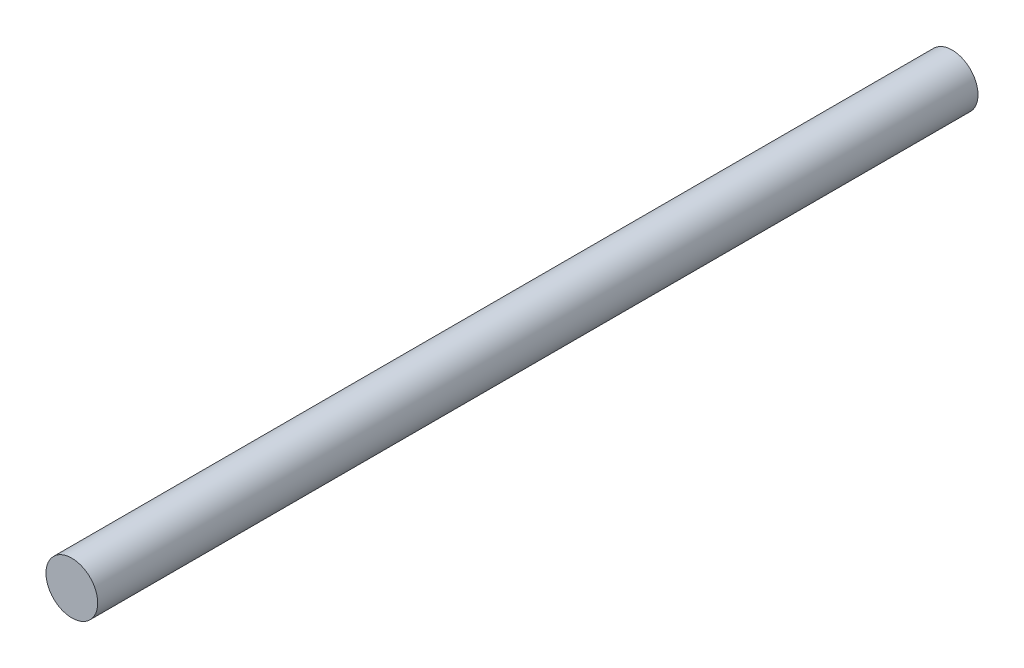
ISO-10303-21;
HEADER;
FILE_DESCRIPTION(('STEP AP214'),'2;1');
FILE_NAME('part.step','',(''),(''),'','','');
FILE_SCHEMA(('AUTOMOTIVE_DESIGN { 1 0 10303 214 1 1 1 1 }'));
ENDSEC;
DATA;
#1=APPLICATION_CONTEXT('core data for automotive mechanical design processes');
#2=APPLICATION_PROTOCOL_DEFINITION('international standard','automotive_design',2000,#1);
#3=PRODUCT_CONTEXT('',#1,'mechanical');
#4=PRODUCT('Part','Part','',(#3));
#5=PRODUCT_RELATED_PRODUCT_CATEGORY('part','',(#4));
#6=PRODUCT_DEFINITION_FORMATION('','',#4);
#7=PRODUCT_DEFINITION_CONTEXT('part definition',#1,'design');
#8=PRODUCT_DEFINITION('design','',#6,#7);
#9=PRODUCT_DEFINITION_SHAPE('','',#8);
#10=(LENGTH_UNIT() NAMED_UNIT(*) SI_UNIT(.MILLI.,.METRE.));
#11=(NAMED_UNIT(*) PLANE_ANGLE_UNIT() SI_UNIT($,.RADIAN.));
#12=(NAMED_UNIT(*) SI_UNIT($,.STERADIAN.) SOLID_ANGLE_UNIT());
#13=UNCERTAINTY_MEASURE_WITH_UNIT(LENGTH_MEASURE(1.E-05),#10,'distance_accuracy_value','');
#14=(GEOMETRIC_REPRESENTATION_CONTEXT(3) GLOBAL_UNCERTAINTY_ASSIGNED_CONTEXT((#13)) GLOBAL_UNIT_ASSIGNED_CONTEXT((#10,
#11,#12)) REPRESENTATION_CONTEXT('',''));
#15=CARTESIAN_POINT('',(0.,0.,0.));
#16=DIRECTION('',(0.,0.,1.));
#17=DIRECTION('',(1.,0.,0.));
#18=AXIS2_PLACEMENT_3D('',#15,#16,#17);
#19=CARTESIAN_POINT('',(0.,0.,136.));
#20=DIRECTION('',(0.,0.,-1.));
#21=DIRECTION('',(-1.,0.,0.));
#22=AXIS2_PLACEMENT_3D('',#19,#20,#21);
#23=CYLINDRICAL_SURFACE('',#22,4.);
#24=CARTESIAN_POINT('',(0.,0.,136.));
#25=DIRECTION('',(0.,0.,1.));
#26=DIRECTION('',(1.,0.,0.));
#27=AXIS2_PLACEMENT_3D('',#24,#25,#26);
#28=CIRCLE('',#27,4.);
#29=CARTESIAN_POINT('',(4.,0.,136.));
#30=VERTEX_POINT('',#29);
#31=EDGE_CURVE('E10',#30,#30,#28,.T.);
#32=ORIENTED_EDGE('',*,*,#31,.F.);
#33=EDGE_LOOP('',(#32));
#34=FACE_BOUND('',#33,.T.);
#35=CARTESIAN_POINT('',(0.,0.,0.));
#36=DIRECTION('',(0.,0.,1.));
#37=DIRECTION('',(1.,0.,0.));
#38=AXIS2_PLACEMENT_3D('',#35,#36,#37);
#39=CIRCLE('',#38,4.);
#40=CARTESIAN_POINT('',(4.,0.,0.));
#41=VERTEX_POINT('',#40);
#42=EDGE_CURVE('E36',#41,#41,#39,.T.);
#43=ORIENTED_EDGE('',*,*,#42,.T.);
#44=EDGE_LOOP('',(#43));
#45=FACE_BOUND('',#44,.T.);
#46=ADVANCED_FACE('F33',(#34,#45),#23,.T.);
#47=CARTESIAN_POINT('',(0.,0.,136.));
#48=DIRECTION('',(0.,0.,1.));
#49=DIRECTION('',(1.,0.,0.));
#50=AXIS2_PLACEMENT_3D('',#47,#48,#49);
#51=PLANE('',#50);
#52=ORIENTED_EDGE('',*,*,#31,.T.);
#53=EDGE_LOOP('',(#52));
#54=FACE_BOUND('',#53,.T.);
#55=ADVANCED_FACE('F48',(#54),#51,.T.);
#56=CARTESIAN_POINT('',(0.,0.,0.));
#57=DIRECTION('',(0.,0.,1.));
#58=DIRECTION('',(1.,0.,0.));
#59=AXIS2_PLACEMENT_3D('',#56,#57,#58);
#60=PLANE('',#59);
#61=ORIENTED_EDGE('',*,*,#42,.F.);
#62=EDGE_LOOP('',(#61));
#63=FACE_BOUND('',#62,.T.);
#64=ADVANCED_FACE('F46',(#63),#60,.F.);
#65=CLOSED_SHELL('',(#46,#55,#64));
#66=MANIFOLD_SOLID_BREP('B2',#65);
#67=ADVANCED_BREP_SHAPE_REPRESENTATION('',(#18,#66),#14);
#68=SHAPE_DEFINITION_REPRESENTATION(#9,#67);
ENDSEC;
END-ISO-10303-21;
